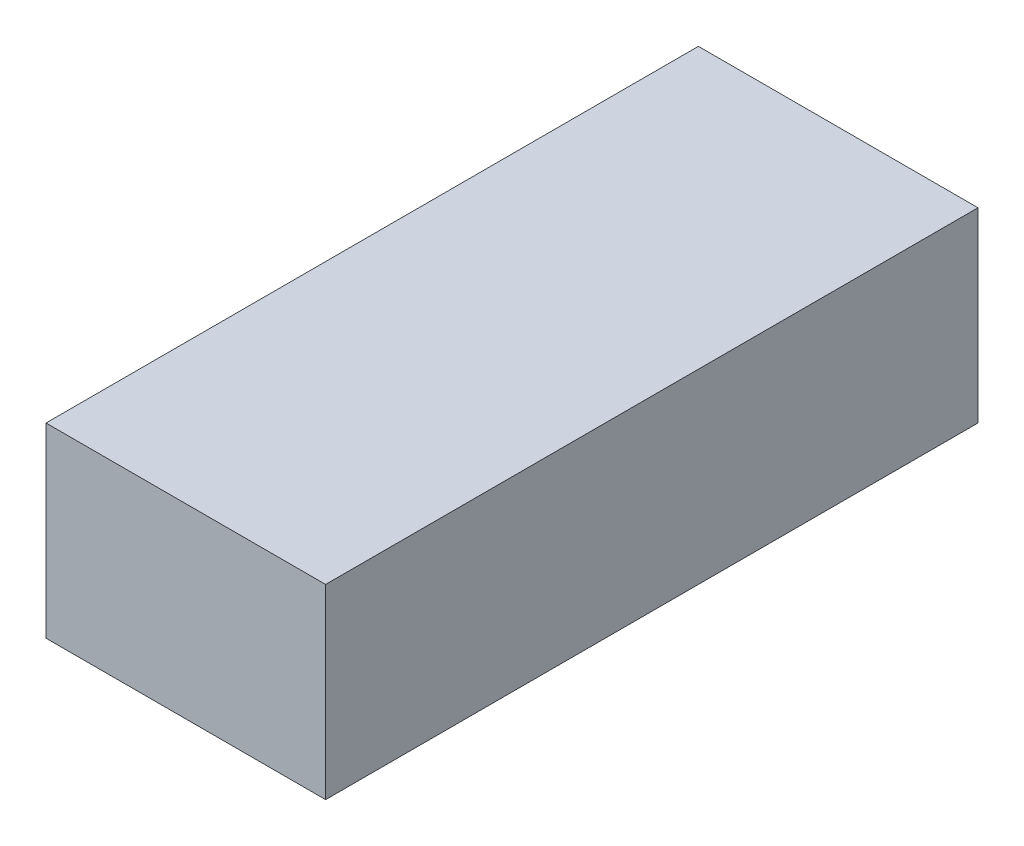
ISO-10303-21;
HEADER;
FILE_DESCRIPTION(('STEP AP214'),'2;1');
FILE_NAME('part.step','',(''),(''),'','','');
FILE_SCHEMA(('AUTOMOTIVE_DESIGN { 1 0 10303 214 1 1 1 1 }'));
ENDSEC;
DATA;
#1=APPLICATION_CONTEXT('core data for automotive mechanical design processes');
#2=APPLICATION_PROTOCOL_DEFINITION('international standard','automotive_design',2000,#1);
#3=PRODUCT_CONTEXT('',#1,'mechanical');
#4=PRODUCT('Part','Part','',(#3));
#5=PRODUCT_RELATED_PRODUCT_CATEGORY('part','',(#4));
#6=PRODUCT_DEFINITION_FORMATION('','',#4);
#7=PRODUCT_DEFINITION_CONTEXT('part definition',#1,'design');
#8=PRODUCT_DEFINITION('design','',#6,#7);
#9=PRODUCT_DEFINITION_SHAPE('','',#8);
#10=(LENGTH_UNIT() NAMED_UNIT(*) SI_UNIT(.MILLI.,.METRE.));
#11=(NAMED_UNIT(*) PLANE_ANGLE_UNIT() SI_UNIT($,.RADIAN.));
#12=(NAMED_UNIT(*) SI_UNIT($,.STERADIAN.) SOLID_ANGLE_UNIT());
#13=UNCERTAINTY_MEASURE_WITH_UNIT(LENGTH_MEASURE(1.E-05),#10,'distance_accuracy_value','');
#14=(GEOMETRIC_REPRESENTATION_CONTEXT(3) GLOBAL_UNCERTAINTY_ASSIGNED_CONTEXT((#13)) GLOBAL_UNIT_ASSIGNED_CONTEXT((#10,
#11,#12)) REPRESENTATION_CONTEXT('',''));
#15=CARTESIAN_POINT('',(0.,0.,0.));
#16=DIRECTION('',(0.,0.,1.));
#17=DIRECTION('',(1.,0.,0.));
#18=AXIS2_PLACEMENT_3D('',#15,#16,#17);
#19=CARTESIAN_POINT('',(0.1499997,0.09999980000001,0.));
#20=DIRECTION('',(0.,-1.,0.));
#21=DIRECTION('',(0.,0.,-1.));
#22=AXIS2_PLACEMENT_3D('',#19,#20,#21);
#23=PLANE('',#22);
#24=DIRECTION('',(0.,0.,-1.));
#25=VECTOR('',#24,1.);
#26=CARTESIAN_POINT('',(-0.1499997,0.09999980000001,0.));
#27=LINE('',#26,#25);
#28=CARTESIAN_POINT('',(-0.1499997,0.09999980000001,0.));
#29=VERTEX_POINT('',#28);
#30=CARTESIAN_POINT('',(-0.1499997,0.09999980000001,0.70000114));
#31=VERTEX_POINT('',#30);
#32=EDGE_CURVE('E20',#29,#31,#27,.F.);
#33=ORIENTED_EDGE('',*,*,#32,.T.);
#34=DIRECTION('',(-1.,0.,0.));
#35=VECTOR('',#34,1.);
#36=CARTESIAN_POINT('',(-0.1499997,0.09999980000001,0.70000114));
#37=LINE('',#36,#35);
#38=CARTESIAN_POINT('',(0.1499997,0.09999980000001,0.70000114));
#39=VERTEX_POINT('',#38);
#40=EDGE_CURVE('E55',#31,#39,#37,.F.);
#41=ORIENTED_EDGE('',*,*,#40,.T.);
#42=DIRECTION('',(0.,0.,1.));
#43=VECTOR('',#42,1.);
#44=CARTESIAN_POINT('',(0.1499997,0.09999980000001,0.));
#45=LINE('',#44,#43);
#46=CARTESIAN_POINT('',(0.1499997,0.09999980000001,0.));
#47=VERTEX_POINT('',#46);
#48=EDGE_CURVE('E76',#39,#47,#45,.F.);
#49=ORIENTED_EDGE('',*,*,#48,.T.);
#50=DIRECTION('',(-1.,0.,0.));
#51=VECTOR('',#50,1.);
#52=CARTESIAN_POINT('',(-0.1499997,0.09999980000001,0.));
#53=LINE('',#52,#51);
#54=EDGE_CURVE('E58',#29,#47,#53,.F.);
#55=ORIENTED_EDGE('',*,*,#54,.F.);
#56=EDGE_LOOP('',(#33,#41,#49,#55));
#57=FACE_BOUND('',#56,.T.);
#58=ADVANCED_FACE('F17',(#57),#23,.F.);
#59=CARTESIAN_POINT('',(-0.1499997,0.09999980000001,0.));
#60=DIRECTION('',(1.,0.,0.));
#61=DIRECTION('',(0.,0.,-1.));
#62=AXIS2_PLACEMENT_3D('',#59,#60,#61);
#63=PLANE('',#62);
#64=DIRECTION('',(0.,0.,1.));
#65=VECTOR('',#64,1.);
#66=CARTESIAN_POINT('',(-0.1499997,-0.09999980000001,0.));
#67=LINE('',#66,#65);
#68=CARTESIAN_POINT('',(-0.1499997,-0.09999980000001,0.));
#69=VERTEX_POINT('',#68);
#70=CARTESIAN_POINT('',(-0.1499997,-0.09999980000001,0.70000114));
#71=VERTEX_POINT('',#70);
#72=EDGE_CURVE('E73',#69,#71,#67,.T.);
#73=ORIENTED_EDGE('',*,*,#72,.T.);
#74=DIRECTION('',(0.,1.,0.));
#75=VECTOR('',#74,1.);
#76=CARTESIAN_POINT('',(-0.1499997,-0.09999980000001,0.70000114));
#77=LINE('',#76,#75);
#78=EDGE_CURVE('E63',#71,#31,#77,.T.);
#79=ORIENTED_EDGE('',*,*,#78,.T.);
#80=ORIENTED_EDGE('',*,*,#32,.F.);
#81=DIRECTION('',(0.,1.,0.));
#82=VECTOR('',#81,1.);
#83=CARTESIAN_POINT('',(-0.1499997,-0.09999980000001,0.));
#84=LINE('',#83,#82);
#85=EDGE_CURVE('E78',#69,#29,#84,.T.);
#86=ORIENTED_EDGE('',*,*,#85,.F.);
#87=EDGE_LOOP('',(#73,#79,#80,#86));
#88=FACE_BOUND('',#87,.T.);
#89=ADVANCED_FACE('F72',(#88),#63,.F.);
#90=CARTESIAN_POINT('',(-0.1499997,-0.09999980000001,0.70000114));
#91=DIRECTION('',(0.,0.,-1.));
#92=DIRECTION('',(-1.,0.,0.));
#93=AXIS2_PLACEMENT_3D('',#90,#91,#92);
#94=PLANE('',#93);
#95=DIRECTION('',(0.,1.,0.));
#96=VECTOR('',#95,1.);
#97=CARTESIAN_POINT('',(0.1499997,-0.09999980000001,0.70000114));
#98=LINE('',#97,#96);
#99=CARTESIAN_POINT('',(0.1499997,-0.09999980000001,0.70000114));
#100=VERTEX_POINT('',#99);
#101=EDGE_CURVE('E69',#100,#39,#98,.T.);
#102=ORIENTED_EDGE('',*,*,#101,.T.);
#103=ORIENTED_EDGE('',*,*,#40,.F.);
#104=ORIENTED_EDGE('',*,*,#78,.F.);
#105=DIRECTION('',(1.,0.,0.));
#106=VECTOR('',#105,1.);
#107=CARTESIAN_POINT('',(-0.1499997,-0.09999980000001,0.70000114));
#108=LINE('',#107,#106);
#109=EDGE_CURVE('E83',#71,#100,#108,.T.);
#110=ORIENTED_EDGE('',*,*,#109,.T.);
#111=EDGE_LOOP('',(#102,#103,#104,#110));
#112=FACE_BOUND('',#111,.T.);
#113=ADVANCED_FACE('F66',(#112),#94,.F.);
#114=CARTESIAN_POINT('',(0.1499997,-0.09999980000001,0.));
#115=DIRECTION('',(-1.,0.,0.));
#116=DIRECTION('',(0.,0.,1.));
#117=AXIS2_PLACEMENT_3D('',#114,#115,#116);
#118=PLANE('',#117);
#119=ORIENTED_EDGE('',*,*,#48,.F.);
#120=ORIENTED_EDGE('',*,*,#101,.F.);
#121=DIRECTION('',(0.,0.,1.));
#122=VECTOR('',#121,1.);
#123=CARTESIAN_POINT('',(0.1499997,-0.09999980000001,0.));
#124=LINE('',#123,#122);
#125=CARTESIAN_POINT('',(0.1499997,-0.09999980000001,0.));
#126=VERTEX_POINT('',#125);
#127=EDGE_CURVE('E26',#100,#126,#124,.F.);
#128=ORIENTED_EDGE('',*,*,#127,.T.);
#129=DIRECTION('',(0.,1.,0.));
#130=VECTOR('',#129,1.);
#131=CARTESIAN_POINT('',(0.1499997,-0.09999980000001,0.));
#132=LINE('',#131,#130);
#133=EDGE_CURVE('E34',#47,#126,#132,.F.);
#134=ORIENTED_EDGE('',*,*,#133,.F.);
#135=EDGE_LOOP('',(#119,#120,#128,#134));
#136=FACE_BOUND('',#135,.T.);
#137=ADVANCED_FACE('F88',(#136),#118,.F.);
#138=CARTESIAN_POINT('',(-0.1499997,-0.09999980000001,0.));
#139=DIRECTION('',(0.,0.,-1.));
#140=DIRECTION('',(-1.,0.,0.));
#141=AXIS2_PLACEMENT_3D('',#138,#139,#140);
#142=PLANE('',#141);
#143=ORIENTED_EDGE('',*,*,#133,.T.);
#144=DIRECTION('',(1.,0.,0.));
#145=VECTOR('',#144,1.);
#146=CARTESIAN_POINT('',(-0.1499997,-0.09999980000001,0.));
#147=LINE('',#146,#145);
#148=EDGE_CURVE('E11',#126,#69,#147,.F.);
#149=ORIENTED_EDGE('',*,*,#148,.T.);
#150=ORIENTED_EDGE('',*,*,#85,.T.);
#151=ORIENTED_EDGE('',*,*,#54,.T.);
#152=EDGE_LOOP('',(#143,#149,#150,#151));
#153=FACE_BOUND('',#152,.T.);
#154=ADVANCED_FACE('F91',(#153),#142,.T.);
#155=CARTESIAN_POINT('',(-0.1499997,-0.09999980000001,0.));
#156=DIRECTION('',(0.,1.,0.));
#157=DIRECTION('',(0.,0.,1.));
#158=AXIS2_PLACEMENT_3D('',#155,#156,#157);
#159=PLANE('',#158);
#160=ORIENTED_EDGE('',*,*,#127,.F.);
#161=ORIENTED_EDGE('',*,*,#109,.F.);
#162=ORIENTED_EDGE('',*,*,#72,.F.);
#163=ORIENTED_EDGE('',*,*,#148,.F.);
#164=EDGE_LOOP('',(#160,#161,#162,#163));
#165=FACE_BOUND('',#164,.T.);
#166=ADVANCED_FACE('F90',(#165),#159,.F.);
#167=CLOSED_SHELL('',(#58,#89,#113,#137,#154,#166));
#168=MANIFOLD_SOLID_BREP('B1',#167);
#169=ADVANCED_BREP_SHAPE_REPRESENTATION('',(#18,#168),#14);
#170=SHAPE_DEFINITION_REPRESENTATION(#9,#169);
ENDSEC;
END-ISO-10303-21;
